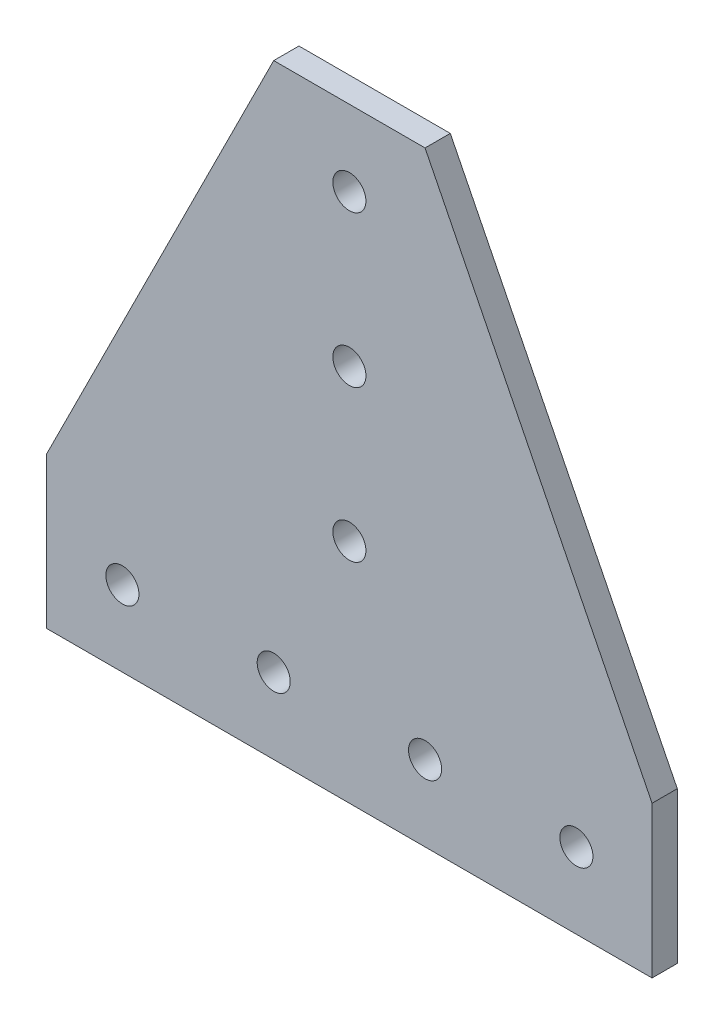
ISO-10303-21;
HEADER;
FILE_DESCRIPTION(('STEP AP214'),'2;1');
FILE_NAME('part.step','',(''),(''),'','','');
FILE_SCHEMA(('AUTOMOTIVE_DESIGN { 1 0 10303 214 1 1 1 1 }'));
ENDSEC;
DATA;
#1=APPLICATION_CONTEXT('core data for automotive mechanical design processes');
#2=APPLICATION_PROTOCOL_DEFINITION('international standard','automotive_design',2000,#1);
#3=PRODUCT_CONTEXT('',#1,'mechanical');
#4=PRODUCT('Part','Part','',(#3));
#5=PRODUCT_RELATED_PRODUCT_CATEGORY('part','',(#4));
#6=PRODUCT_DEFINITION_FORMATION('','',#4);
#7=PRODUCT_DEFINITION_CONTEXT('part definition',#1,'design');
#8=PRODUCT_DEFINITION('design','',#6,#7);
#9=PRODUCT_DEFINITION_SHAPE('','',#8);
#10=(LENGTH_UNIT() NAMED_UNIT(*) SI_UNIT(.MILLI.,.METRE.));
#11=(NAMED_UNIT(*) PLANE_ANGLE_UNIT() SI_UNIT($,.RADIAN.));
#12=(NAMED_UNIT(*) SI_UNIT($,.STERADIAN.) SOLID_ANGLE_UNIT());
#13=UNCERTAINTY_MEASURE_WITH_UNIT(LENGTH_MEASURE(1.E-05),#10,'distance_accuracy_value','');
#14=(GEOMETRIC_REPRESENTATION_CONTEXT(3) GLOBAL_UNCERTAINTY_ASSIGNED_CONTEXT((#13)) GLOBAL_UNIT_ASSIGNED_CONTEXT((#10,
#11,#12)) REPRESENTATION_CONTEXT('',''));
#15=CARTESIAN_POINT('',(0.,0.,0.));
#16=DIRECTION('',(0.,0.,1.));
#17=DIRECTION('',(1.,0.,0.));
#18=AXIS2_PLACEMENT_3D('',#15,#16,#17);
#19=CARTESIAN_POINT('',(19.05,152.4,0.));
#20=DIRECTION('',(0.,1.,0.));
#21=DIRECTION('',(-1.,0.,0.));
#22=AXIS2_PLACEMENT_3D('',#19,#20,#21);
#23=PLANE('',#22);
#24=DIRECTION('',(-1.,0.,0.));
#25=VECTOR('',#24,1.);
#26=CARTESIAN_POINT('',(19.05,152.4,6.35));
#27=LINE('',#26,#25);
#28=CARTESIAN_POINT('',(19.05,152.4,6.35));
#29=VERTEX_POINT('',#28);
#30=CARTESIAN_POINT('',(-19.05,152.4,6.35));
#31=VERTEX_POINT('',#30);
#32=EDGE_CURVE('E119',#29,#31,#27,.T.);
#33=ORIENTED_EDGE('',*,*,#32,.F.);
#34=DIRECTION('',(0.,0.,1.));
#35=VECTOR('',#34,1.);
#36=CARTESIAN_POINT('',(19.05,152.4,0.));
#37=LINE('',#36,#35);
#38=CARTESIAN_POINT('',(19.05,152.4,0.));
#39=VERTEX_POINT('',#38);
#40=EDGE_CURVE('E11',#39,#29,#37,.T.);
#41=ORIENTED_EDGE('',*,*,#40,.F.);
#42=DIRECTION('',(-1.,0.,0.));
#43=VECTOR('',#42,1.);
#44=CARTESIAN_POINT('',(19.05,152.4,0.));
#45=LINE('',#44,#43);
#46=CARTESIAN_POINT('',(-19.05,152.4,0.));
#47=VERTEX_POINT('',#46);
#48=EDGE_CURVE('E134',#39,#47,#45,.T.);
#49=ORIENTED_EDGE('',*,*,#48,.T.);
#50=DIRECTION('',(0.,0.,1.));
#51=VECTOR('',#50,1.);
#52=CARTESIAN_POINT('',(-19.05,152.4,0.));
#53=LINE('',#52,#51);
#54=EDGE_CURVE('E37',#47,#31,#53,.T.);
#55=ORIENTED_EDGE('',*,*,#54,.T.);
#56=EDGE_LOOP('',(#33,#41,#49,#55));
#57=FACE_BOUND('',#56,.T.);
#58=ADVANCED_FACE('F34',(#57),#23,.T.);
#59=CARTESIAN_POINT('',(76.2,38.1,0.));
#60=DIRECTION('',(0.894427190999916,0.447213595499958,0.));
#61=DIRECTION('',(-0.447213595499958,0.894427190999916,0.));
#62=AXIS2_PLACEMENT_3D('',#59,#60,#61);
#63=PLANE('',#62);
#64=DIRECTION('',(-0.447213595499958,0.894427190999916,0.));
#65=VECTOR('',#64,1.);
#66=CARTESIAN_POINT('',(76.2,38.1,6.35));
#67=LINE('',#66,#65);
#68=CARTESIAN_POINT('',(76.2,38.1,6.35));
#69=VERTEX_POINT('',#68);
#70=EDGE_CURVE('E132',#69,#29,#67,.T.);
#71=ORIENTED_EDGE('',*,*,#70,.F.);
#72=DIRECTION('',(0.,0.,1.));
#73=VECTOR('',#72,1.);
#74=CARTESIAN_POINT('',(76.2,38.1,0.));
#75=LINE('',#74,#73);
#76=CARTESIAN_POINT('',(76.2,38.1,0.));
#77=VERTEX_POINT('',#76);
#78=EDGE_CURVE('E43',#77,#69,#75,.T.);
#79=ORIENTED_EDGE('',*,*,#78,.F.);
#80=DIRECTION('',(-0.447213595499958,0.894427190999916,0.));
#81=VECTOR('',#80,1.);
#82=CARTESIAN_POINT('',(76.2,38.1,0.));
#83=LINE('',#82,#81);
#84=EDGE_CURVE('E109',#77,#39,#83,.T.);
#85=ORIENTED_EDGE('',*,*,#84,.T.);
#86=ORIENTED_EDGE('',*,*,#40,.T.);
#87=EDGE_LOOP('',(#71,#79,#85,#86));
#88=FACE_BOUND('',#87,.T.);
#89=ADVANCED_FACE('F142',(#88),#63,.T.);
#90=CARTESIAN_POINT('',(76.2,0.,0.));
#91=DIRECTION('',(1.,0.,0.));
#92=DIRECTION('',(0.,0.,-1.));
#93=AXIS2_PLACEMENT_3D('',#90,#91,#92);
#94=PLANE('',#93);
#95=DIRECTION('',(0.,1.,0.));
#96=VECTOR('',#95,1.);
#97=CARTESIAN_POINT('',(76.2,0.,6.35));
#98=LINE('',#97,#96);
#99=CARTESIAN_POINT('',(76.2,0.,6.35));
#100=VERTEX_POINT('',#99);
#101=EDGE_CURVE('E96',#100,#69,#98,.T.);
#102=ORIENTED_EDGE('',*,*,#101,.F.);
#103=DIRECTION('',(0.,0.,1.));
#104=VECTOR('',#103,1.);
#105=CARTESIAN_POINT('',(76.2,0.,0.));
#106=LINE('',#105,#104);
#107=CARTESIAN_POINT('',(76.2,0.,0.));
#108=VERTEX_POINT('',#107);
#109=EDGE_CURVE('E91',#108,#100,#106,.T.);
#110=ORIENTED_EDGE('',*,*,#109,.F.);
#111=DIRECTION('',(0.,1.,0.));
#112=VECTOR('',#111,1.);
#113=CARTESIAN_POINT('',(76.2,0.,0.));
#114=LINE('',#113,#112);
#115=EDGE_CURVE('E94',#108,#77,#114,.T.);
#116=ORIENTED_EDGE('',*,*,#115,.T.);
#117=ORIENTED_EDGE('',*,*,#78,.T.);
#118=EDGE_LOOP('',(#102,#110,#116,#117));
#119=FACE_BOUND('',#118,.T.);
#120=ADVANCED_FACE('F93',(#119),#94,.T.);
#121=CARTESIAN_POINT('',(-76.2,0.,0.));
#122=DIRECTION('',(0.,-1.,0.));
#123=DIRECTION('',(1.,0.,0.));
#124=AXIS2_PLACEMENT_3D('',#121,#122,#123);
#125=PLANE('',#124);
#126=DIRECTION('',(1.,0.,0.));
#127=VECTOR('',#126,1.);
#128=CARTESIAN_POINT('',(-76.2,0.,6.35));
#129=LINE('',#128,#127);
#130=CARTESIAN_POINT('',(-76.2,0.,6.35));
#131=VERTEX_POINT('',#130);
#132=EDGE_CURVE('E129',#131,#100,#129,.T.);
#133=ORIENTED_EDGE('',*,*,#132,.F.);
#134=DIRECTION('',(0.,0.,1.));
#135=VECTOR('',#134,1.);
#136=CARTESIAN_POINT('',(-76.2,0.,0.));
#137=LINE('',#136,#135);
#138=CARTESIAN_POINT('',(-76.2,0.,0.));
#139=VERTEX_POINT('',#138);
#140=EDGE_CURVE('E101',#139,#131,#137,.T.);
#141=ORIENTED_EDGE('',*,*,#140,.F.);
#142=DIRECTION('',(1.,0.,0.));
#143=VECTOR('',#142,1.);
#144=CARTESIAN_POINT('',(-76.2,0.,0.));
#145=LINE('',#144,#143);
#146=EDGE_CURVE('E107',#139,#108,#145,.T.);
#147=ORIENTED_EDGE('',*,*,#146,.T.);
#148=ORIENTED_EDGE('',*,*,#109,.T.);
#149=EDGE_LOOP('',(#133,#141,#147,#148));
#150=FACE_BOUND('',#149,.T.);
#151=ADVANCED_FACE('F111',(#150),#125,.T.);
#152=CARTESIAN_POINT('',(-76.2,38.1,0.));
#153=DIRECTION('',(-1.,0.,0.));
#154=DIRECTION('',(0.,-1.,0.));
#155=AXIS2_PLACEMENT_3D('',#152,#153,#154);
#156=PLANE('',#155);
#157=DIRECTION('',(0.,-1.,0.));
#158=VECTOR('',#157,1.);
#159=CARTESIAN_POINT('',(-76.2,38.1,6.35));
#160=LINE('',#159,#158);
#161=CARTESIAN_POINT('',(-76.2,38.1,6.35));
#162=VERTEX_POINT('',#161);
#163=EDGE_CURVE('E126',#162,#131,#160,.T.);
#164=ORIENTED_EDGE('',*,*,#163,.F.);
#165=DIRECTION('',(0.,0.,1.));
#166=VECTOR('',#165,1.);
#167=CARTESIAN_POINT('',(-76.2,38.1,0.));
#168=LINE('',#167,#166);
#169=CARTESIAN_POINT('',(-76.2,38.1,0.));
#170=VERTEX_POINT('',#169);
#171=EDGE_CURVE('E137',#170,#162,#168,.T.);
#172=ORIENTED_EDGE('',*,*,#171,.F.);
#173=DIRECTION('',(0.,-1.,0.));
#174=VECTOR('',#173,1.);
#175=CARTESIAN_POINT('',(-76.2,38.1,0.));
#176=LINE('',#175,#174);
#177=EDGE_CURVE('E112',#170,#139,#176,.T.);
#178=ORIENTED_EDGE('',*,*,#177,.T.);
#179=ORIENTED_EDGE('',*,*,#140,.T.);
#180=EDGE_LOOP('',(#164,#172,#178,#179));
#181=FACE_BOUND('',#180,.T.);
#182=ADVANCED_FACE('F155',(#181),#156,.T.);
#183=CARTESIAN_POINT('',(-19.05,152.4,0.));
#184=DIRECTION('',(-0.894427190999916,0.447213595499958,0.));
#185=DIRECTION('',(-0.447213595499958,-0.894427190999916,0.));
#186=AXIS2_PLACEMENT_3D('',#183,#184,#185);
#187=PLANE('',#186);
#188=DIRECTION('',(-0.447213595499958,-0.894427190999916,0.));
#189=VECTOR('',#188,1.);
#190=CARTESIAN_POINT('',(-19.05,152.4,6.35));
#191=LINE('',#190,#189);
#192=EDGE_CURVE('E122',#31,#162,#191,.T.);
#193=ORIENTED_EDGE('',*,*,#192,.F.);
#194=ORIENTED_EDGE('',*,*,#54,.F.);
#195=DIRECTION('',(-0.447213595499958,-0.894427190999916,0.));
#196=VECTOR('',#195,1.);
#197=CARTESIAN_POINT('',(-19.05,152.4,0.));
#198=LINE('',#197,#196);
#199=EDGE_CURVE('E114',#47,#170,#198,.T.);
#200=ORIENTED_EDGE('',*,*,#199,.T.);
#201=ORIENTED_EDGE('',*,*,#171,.T.);
#202=EDGE_LOOP('',(#193,#194,#200,#201));
#203=FACE_BOUND('',#202,.T.);
#204=ADVANCED_FACE('F139',(#203),#187,.T.);
#205=CARTESIAN_POINT('',(0.,0.,0.));
#206=DIRECTION('',(0.,0.,1.));
#207=DIRECTION('',(1.,0.,0.));
#208=AXIS2_PLACEMENT_3D('',#205,#206,#207);
#209=PLANE('',#208);
#210=CARTESIAN_POINT('',(57.15,19.05,0.));
#211=DIRECTION('',(0.,0.,1.));
#212=DIRECTION('',(-1.,0.,0.));
#213=AXIS2_PLACEMENT_3D('',#210,#211,#212);
#214=CIRCLE('',#213,4.1656);
#215=CARTESIAN_POINT('',(52.9844,19.05,0.));
#216=VERTEX_POINT('',#215);
#217=EDGE_CURVE('E201',#216,#216,#214,.T.);
#218=ORIENTED_EDGE('',*,*,#217,.T.);
#219=EDGE_LOOP('',(#218));
#220=FACE_BOUND('',#219,.T.);
#221=CARTESIAN_POINT('',(19.05,19.05,0.));
#222=DIRECTION('',(0.,0.,1.));
#223=DIRECTION('',(-1.,0.,0.));
#224=AXIS2_PLACEMENT_3D('',#221,#222,#223);
#225=CIRCLE('',#224,4.1656);
#226=CARTESIAN_POINT('',(14.8844,19.05,0.));
#227=VERTEX_POINT('',#226);
#228=EDGE_CURVE('E209',#227,#227,#225,.T.);
#229=ORIENTED_EDGE('',*,*,#228,.T.);
#230=EDGE_LOOP('',(#229));
#231=FACE_BOUND('',#230,.T.);
#232=CARTESIAN_POINT('',(0.,57.15,0.));
#233=DIRECTION('',(0.,0.,1.));
#234=DIRECTION('',(-1.,0.,0.));
#235=AXIS2_PLACEMENT_3D('',#232,#233,#234);
#236=CIRCLE('',#235,4.1656);
#237=CARTESIAN_POINT('',(-4.1656,57.15,0.));
#238=VERTEX_POINT('',#237);
#239=EDGE_CURVE('E215',#238,#238,#236,.T.);
#240=ORIENTED_EDGE('',*,*,#239,.T.);
#241=EDGE_LOOP('',(#240));
#242=FACE_BOUND('',#241,.T.);
#243=CARTESIAN_POINT('',(0.,95.25,0.));
#244=DIRECTION('',(0.,0.,1.));
#245=DIRECTION('',(-1.,0.,0.));
#246=AXIS2_PLACEMENT_3D('',#243,#244,#245);
#247=CIRCLE('',#246,4.1656);
#248=CARTESIAN_POINT('',(-4.1656,95.25,0.));
#249=VERTEX_POINT('',#248);
#250=EDGE_CURVE('E221',#249,#249,#247,.T.);
#251=ORIENTED_EDGE('',*,*,#250,.T.);
#252=EDGE_LOOP('',(#251));
#253=FACE_BOUND('',#252,.T.);
#254=CARTESIAN_POINT('',(0.,133.35,0.));
#255=DIRECTION('',(0.,0.,1.));
#256=DIRECTION('',(-1.,0.,0.));
#257=AXIS2_PLACEMENT_3D('',#254,#255,#256);
#258=CIRCLE('',#257,4.1656);
#259=CARTESIAN_POINT('',(-4.1656,133.35,0.));
#260=VERTEX_POINT('',#259);
#261=EDGE_CURVE('E227',#260,#260,#258,.T.);
#262=ORIENTED_EDGE('',*,*,#261,.T.);
#263=EDGE_LOOP('',(#262));
#264=FACE_BOUND('',#263,.T.);
#265=CARTESIAN_POINT('',(-19.05,19.05,0.));
#266=DIRECTION('',(0.,0.,1.));
#267=DIRECTION('',(-1.,0.,0.));
#268=AXIS2_PLACEMENT_3D('',#265,#266,#267);
#269=CIRCLE('',#268,4.1656);
#270=CARTESIAN_POINT('',(-23.2156,19.05,0.));
#271=VERTEX_POINT('',#270);
#272=EDGE_CURVE('E233',#271,#271,#269,.T.);
#273=ORIENTED_EDGE('',*,*,#272,.T.);
#274=EDGE_LOOP('',(#273));
#275=FACE_BOUND('',#274,.T.);
#276=CARTESIAN_POINT('',(-57.15,19.05,0.));
#277=DIRECTION('',(0.,0.,1.));
#278=DIRECTION('',(-1.,0.,0.));
#279=AXIS2_PLACEMENT_3D('',#276,#277,#278);
#280=CIRCLE('',#279,4.1656);
#281=CARTESIAN_POINT('',(-61.3156,19.05,0.));
#282=VERTEX_POINT('',#281);
#283=EDGE_CURVE('E123',#282,#282,#280,.T.);
#284=ORIENTED_EDGE('',*,*,#283,.T.);
#285=EDGE_LOOP('',(#284));
#286=FACE_BOUND('',#285,.T.);
#287=ORIENTED_EDGE('',*,*,#48,.F.);
#288=ORIENTED_EDGE('',*,*,#84,.F.);
#289=ORIENTED_EDGE('',*,*,#115,.F.);
#290=ORIENTED_EDGE('',*,*,#146,.F.);
#291=ORIENTED_EDGE('',*,*,#177,.F.);
#292=ORIENTED_EDGE('',*,*,#199,.F.);
#293=EDGE_LOOP('',(#287,#288,#289,#290,#291,#292));
#294=FACE_BOUND('',#293,.T.);
#295=ADVANCED_FACE('F105',(#220,#231,#242,#253,#264,#275,#286,#294),#209,.F.);
#296=CARTESIAN_POINT('',(0.,0.,6.35));
#297=DIRECTION('',(0.,0.,1.));
#298=DIRECTION('',(1.,0.,0.));
#299=AXIS2_PLACEMENT_3D('',#296,#297,#298);
#300=PLANE('',#299);
#301=CARTESIAN_POINT('',(57.15,19.05,6.35));
#302=DIRECTION('',(0.,0.,1.));
#303=DIRECTION('',(-1.,0.,0.));
#304=AXIS2_PLACEMENT_3D('',#301,#302,#303);
#305=CIRCLE('',#304,4.1656);
#306=CARTESIAN_POINT('',(52.9844,19.05,6.35));
#307=VERTEX_POINT('',#306);
#308=EDGE_CURVE('E204',#307,#307,#305,.T.);
#309=ORIENTED_EDGE('',*,*,#308,.F.);
#310=EDGE_LOOP('',(#309));
#311=FACE_BOUND('',#310,.T.);
#312=CARTESIAN_POINT('',(19.05,19.05,6.35));
#313=DIRECTION('',(0.,0.,1.));
#314=DIRECTION('',(-1.,0.,0.));
#315=AXIS2_PLACEMENT_3D('',#312,#313,#314);
#316=CIRCLE('',#315,4.1656);
#317=CARTESIAN_POINT('',(14.8844,19.05,6.35));
#318=VERTEX_POINT('',#317);
#319=EDGE_CURVE('E206',#318,#318,#316,.T.);
#320=ORIENTED_EDGE('',*,*,#319,.F.);
#321=EDGE_LOOP('',(#320));
#322=FACE_BOUND('',#321,.T.);
#323=CARTESIAN_POINT('',(0.,57.15,6.35));
#324=DIRECTION('',(0.,0.,1.));
#325=DIRECTION('',(-1.,0.,0.));
#326=AXIS2_PLACEMENT_3D('',#323,#324,#325);
#327=CIRCLE('',#326,4.1656);
#328=CARTESIAN_POINT('',(-4.1656,57.15,6.35));
#329=VERTEX_POINT('',#328);
#330=EDGE_CURVE('E212',#329,#329,#327,.T.);
#331=ORIENTED_EDGE('',*,*,#330,.F.);
#332=EDGE_LOOP('',(#331));
#333=FACE_BOUND('',#332,.T.);
#334=CARTESIAN_POINT('',(0.,95.25,6.35));
#335=DIRECTION('',(0.,0.,1.));
#336=DIRECTION('',(-1.,0.,0.));
#337=AXIS2_PLACEMENT_3D('',#334,#335,#336);
#338=CIRCLE('',#337,4.1656);
#339=CARTESIAN_POINT('',(-4.1656,95.25,6.35));
#340=VERTEX_POINT('',#339);
#341=EDGE_CURVE('E218',#340,#340,#338,.T.);
#342=ORIENTED_EDGE('',*,*,#341,.F.);
#343=EDGE_LOOP('',(#342));
#344=FACE_BOUND('',#343,.T.);
#345=CARTESIAN_POINT('',(0.,133.35,6.35));
#346=DIRECTION('',(0.,0.,1.));
#347=DIRECTION('',(-1.,0.,0.));
#348=AXIS2_PLACEMENT_3D('',#345,#346,#347);
#349=CIRCLE('',#348,4.1656);
#350=CARTESIAN_POINT('',(-4.1656,133.35,6.35));
#351=VERTEX_POINT('',#350);
#352=EDGE_CURVE('E224',#351,#351,#349,.T.);
#353=ORIENTED_EDGE('',*,*,#352,.F.);
#354=EDGE_LOOP('',(#353));
#355=FACE_BOUND('',#354,.T.);
#356=CARTESIAN_POINT('',(-19.05,19.05,6.35));
#357=DIRECTION('',(0.,0.,1.));
#358=DIRECTION('',(-1.,0.,0.));
#359=AXIS2_PLACEMENT_3D('',#356,#357,#358);
#360=CIRCLE('',#359,4.1656);
#361=CARTESIAN_POINT('',(-23.2156,19.05,6.35));
#362=VERTEX_POINT('',#361);
#363=EDGE_CURVE('E230',#362,#362,#360,.T.);
#364=ORIENTED_EDGE('',*,*,#363,.F.);
#365=EDGE_LOOP('',(#364));
#366=FACE_BOUND('',#365,.T.);
#367=CARTESIAN_POINT('',(-57.15,19.05,6.35));
#368=DIRECTION('',(0.,0.,1.));
#369=DIRECTION('',(-1.,0.,0.));
#370=AXIS2_PLACEMENT_3D('',#367,#368,#369);
#371=CIRCLE('',#370,4.1656);
#372=CARTESIAN_POINT('',(-61.3156,19.05,6.35));
#373=VERTEX_POINT('',#372);
#374=EDGE_CURVE('E236',#373,#373,#371,.T.);
#375=ORIENTED_EDGE('',*,*,#374,.F.);
#376=EDGE_LOOP('',(#375));
#377=FACE_BOUND('',#376,.T.);
#378=ORIENTED_EDGE('',*,*,#32,.T.);
#379=ORIENTED_EDGE('',*,*,#192,.T.);
#380=ORIENTED_EDGE('',*,*,#163,.T.);
#381=ORIENTED_EDGE('',*,*,#132,.T.);
#382=ORIENTED_EDGE('',*,*,#101,.T.);
#383=ORIENTED_EDGE('',*,*,#70,.T.);
#384=EDGE_LOOP('',(#378,#379,#380,#381,#382,#383));
#385=FACE_BOUND('',#384,.T.);
#386=ADVANCED_FACE('F141',(#311,#322,#333,#344,#355,#366,#377,#385),#300,.T.);
#387=CARTESIAN_POINT('',(-57.15,19.05,0.));
#388=DIRECTION('',(0.,0.,1.));
#389=DIRECTION('',(1.,0.,0.));
#390=AXIS2_PLACEMENT_3D('',#387,#388,#389);
#391=CYLINDRICAL_SURFACE('',#390,4.1656);
#392=ORIENTED_EDGE('',*,*,#283,.F.);
#393=EDGE_LOOP('',(#392));
#394=FACE_BOUND('',#393,.T.);
#395=ORIENTED_EDGE('',*,*,#374,.T.);
#396=EDGE_LOOP('',(#395));
#397=FACE_BOUND('',#396,.T.);
#398=ADVANCED_FACE('F166',(#394,#397),#391,.F.);
#399=CARTESIAN_POINT('',(-19.05,19.05,0.));
#400=DIRECTION('',(0.,0.,1.));
#401=DIRECTION('',(1.,0.,0.));
#402=AXIS2_PLACEMENT_3D('',#399,#400,#401);
#403=CYLINDRICAL_SURFACE('',#402,4.1656);
#404=ORIENTED_EDGE('',*,*,#272,.F.);
#405=EDGE_LOOP('',(#404));
#406=FACE_BOUND('',#405,.T.);
#407=ORIENTED_EDGE('',*,*,#363,.T.);
#408=EDGE_LOOP('',(#407));
#409=FACE_BOUND('',#408,.T.);
#410=ADVANCED_FACE('F173',(#406,#409),#403,.F.);
#411=CARTESIAN_POINT('',(0.,133.35,0.));
#412=DIRECTION('',(0.,0.,1.));
#413=DIRECTION('',(1.,0.,0.));
#414=AXIS2_PLACEMENT_3D('',#411,#412,#413);
#415=CYLINDRICAL_SURFACE('',#414,4.1656);
#416=ORIENTED_EDGE('',*,*,#261,.F.);
#417=EDGE_LOOP('',(#416));
#418=FACE_BOUND('',#417,.T.);
#419=ORIENTED_EDGE('',*,*,#352,.T.);
#420=EDGE_LOOP('',(#419));
#421=FACE_BOUND('',#420,.T.);
#422=ADVANCED_FACE('F177',(#418,#421),#415,.F.);
#423=CARTESIAN_POINT('',(0.,95.25,0.));
#424=DIRECTION('',(0.,0.,1.));
#425=DIRECTION('',(1.,0.,0.));
#426=AXIS2_PLACEMENT_3D('',#423,#424,#425);
#427=CYLINDRICAL_SURFACE('',#426,4.1656);
#428=ORIENTED_EDGE('',*,*,#250,.F.);
#429=EDGE_LOOP('',(#428));
#430=FACE_BOUND('',#429,.T.);
#431=ORIENTED_EDGE('',*,*,#341,.T.);
#432=EDGE_LOOP('',(#431));
#433=FACE_BOUND('',#432,.T.);
#434=ADVANCED_FACE('F181',(#430,#433),#427,.F.);
#435=CARTESIAN_POINT('',(0.,57.15,0.));
#436=DIRECTION('',(0.,0.,1.));
#437=DIRECTION('',(1.,0.,0.));
#438=AXIS2_PLACEMENT_3D('',#435,#436,#437);
#439=CYLINDRICAL_SURFACE('',#438,4.1656);
#440=ORIENTED_EDGE('',*,*,#239,.F.);
#441=EDGE_LOOP('',(#440));
#442=FACE_BOUND('',#441,.T.);
#443=ORIENTED_EDGE('',*,*,#330,.T.);
#444=EDGE_LOOP('',(#443));
#445=FACE_BOUND('',#444,.T.);
#446=ADVANCED_FACE('F185',(#442,#445),#439,.F.);
#447=CARTESIAN_POINT('',(19.05,19.05,0.));
#448=DIRECTION('',(0.,0.,1.));
#449=DIRECTION('',(1.,0.,0.));
#450=AXIS2_PLACEMENT_3D('',#447,#448,#449);
#451=CYLINDRICAL_SURFACE('',#450,4.1656);
#452=ORIENTED_EDGE('',*,*,#228,.F.);
#453=EDGE_LOOP('',(#452));
#454=FACE_BOUND('',#453,.T.);
#455=ORIENTED_EDGE('',*,*,#319,.T.);
#456=EDGE_LOOP('',(#455));
#457=FACE_BOUND('',#456,.T.);
#458=ADVANCED_FACE('F189',(#454,#457),#451,.F.);
#459=CARTESIAN_POINT('',(57.15,19.05,0.));
#460=DIRECTION('',(0.,0.,1.));
#461=DIRECTION('',(1.,0.,0.));
#462=AXIS2_PLACEMENT_3D('',#459,#460,#461);
#463=CYLINDRICAL_SURFACE('',#462,4.1656);
#464=ORIENTED_EDGE('',*,*,#217,.F.);
#465=EDGE_LOOP('',(#464));
#466=FACE_BOUND('',#465,.T.);
#467=ORIENTED_EDGE('',*,*,#308,.T.);
#468=EDGE_LOOP('',(#467));
#469=FACE_BOUND('',#468,.T.);
#470=ADVANCED_FACE('F193',(#466,#469),#463,.F.);
#471=CLOSED_SHELL('',(#58,#89,#120,#151,#182,#204,#295,#386,#398,#410,#422,#434,#446,#458,#470));
#472=MANIFOLD_SOLID_BREP('B2',#471);
#473=ADVANCED_BREP_SHAPE_REPRESENTATION('',(#18,#472),#14);
#474=SHAPE_DEFINITION_REPRESENTATION(#9,#473);
ENDSEC;
END-ISO-10303-21;
